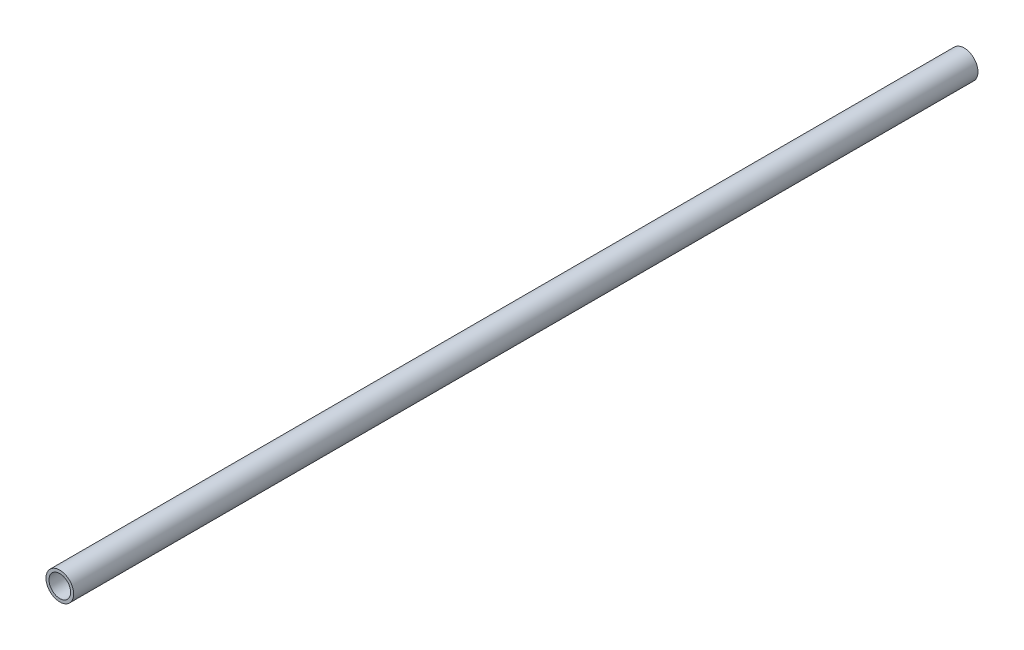
ISO-10303-21;
HEADER;
FILE_DESCRIPTION(('STEP AP214'),'2;1');
FILE_NAME('part.step','',(''),(''),'','','');
FILE_SCHEMA(('AUTOMOTIVE_DESIGN { 1 0 10303 214 1 1 1 1 }'));
ENDSEC;
DATA;
#1=APPLICATION_CONTEXT('core data for automotive mechanical design processes');
#2=APPLICATION_PROTOCOL_DEFINITION('international standard','automotive_design',2000,#1);
#3=PRODUCT_CONTEXT('',#1,'mechanical');
#4=PRODUCT('Part','Part','',(#3));
#5=PRODUCT_RELATED_PRODUCT_CATEGORY('part','',(#4));
#6=PRODUCT_DEFINITION_FORMATION('','',#4);
#7=PRODUCT_DEFINITION_CONTEXT('part definition',#1,'design');
#8=PRODUCT_DEFINITION('design','',#6,#7);
#9=PRODUCT_DEFINITION_SHAPE('','',#8);
#10=(LENGTH_UNIT() NAMED_UNIT(*) SI_UNIT(.MILLI.,.METRE.));
#11=(NAMED_UNIT(*) PLANE_ANGLE_UNIT() SI_UNIT($,.RADIAN.));
#12=(NAMED_UNIT(*) SI_UNIT($,.STERADIAN.) SOLID_ANGLE_UNIT());
#13=UNCERTAINTY_MEASURE_WITH_UNIT(LENGTH_MEASURE(1.E-05),#10,'distance_accuracy_value','');
#14=(GEOMETRIC_REPRESENTATION_CONTEXT(3) GLOBAL_UNCERTAINTY_ASSIGNED_CONTEXT((#13)) GLOBAL_UNIT_ASSIGNED_CONTEXT((#10,
#11,#12)) REPRESENTATION_CONTEXT('',''));
#15=CARTESIAN_POINT('',(0.,0.,0.));
#16=DIRECTION('',(0.,0.,1.));
#17=DIRECTION('',(1.,0.,0.));
#18=AXIS2_PLACEMENT_3D('',#15,#16,#17);
#19=CARTESIAN_POINT('',(0.,0.,1092.2));
#20=DIRECTION('',(0.,0.,1.));
#21=DIRECTION('',(1.,0.,0.));
#22=AXIS2_PLACEMENT_3D('',#19,#20,#21);
#23=CYLINDRICAL_SURFACE('',#22,13.0683);
#24=CARTESIAN_POINT('',(0.,0.,0.));
#25=DIRECTION('',(0.,0.,1.));
#26=DIRECTION('',(1.,0.,0.));
#27=AXIS2_PLACEMENT_3D('',#24,#25,#26);
#28=CIRCLE('',#27,13.0683);
#29=CARTESIAN_POINT('',(13.0683,0.,0.));
#30=VERTEX_POINT('',#29);
#31=EDGE_CURVE('E24',#30,#30,#28,.F.);
#32=ORIENTED_EDGE('',*,*,#31,.T.);
#33=EDGE_LOOP('',(#32));
#34=FACE_BOUND('',#33,.T.);
#35=CARTESIAN_POINT('',(0.,0.,1092.2));
#36=DIRECTION('',(0.,0.,1.));
#37=DIRECTION('',(1.,0.,0.));
#38=AXIS2_PLACEMENT_3D('',#35,#36,#37);
#39=CIRCLE('',#38,13.0683);
#40=CARTESIAN_POINT('',(13.0683,0.,1092.2));
#41=VERTEX_POINT('',#40);
#42=EDGE_CURVE('E15',#41,#41,#39,.F.);
#43=ORIENTED_EDGE('',*,*,#42,.F.);
#44=EDGE_LOOP('',(#43));
#45=FACE_BOUND('',#44,.T.);
#46=ADVANCED_FACE('F12',(#34,#45),#23,.F.);
#47=CARTESIAN_POINT('',(0.,0.,1092.2));
#48=DIRECTION('',(0.,0.,1.));
#49=DIRECTION('',(1.,0.,0.));
#50=AXIS2_PLACEMENT_3D('',#47,#48,#49);
#51=PLANE('',#50);
#52=CARTESIAN_POINT('',(0.,0.,1092.2));
#53=DIRECTION('',(0.,0.,1.));
#54=DIRECTION('',(1.,0.,0.));
#55=AXIS2_PLACEMENT_3D('',#52,#53,#54);
#56=CIRCLE('',#55,16.7005);
#57=CARTESIAN_POINT('',(16.7005,0.,1092.2));
#58=VERTEX_POINT('',#57);
#59=EDGE_CURVE('E19',#58,#58,#56,.F.);
#60=ORIENTED_EDGE('',*,*,#59,.F.);
#61=EDGE_LOOP('',(#60));
#62=FACE_BOUND('',#61,.T.);
#63=ORIENTED_EDGE('',*,*,#42,.T.);
#64=EDGE_LOOP('',(#63));
#65=FACE_BOUND('',#64,.T.);
#66=ADVANCED_FACE('F32',(#62,#65),#51,.T.);
#67=CARTESIAN_POINT('',(0.,0.,0.));
#68=DIRECTION('',(0.,0.,1.));
#69=DIRECTION('',(1.,0.,0.));
#70=AXIS2_PLACEMENT_3D('',#67,#68,#69);
#71=PLANE('',#70);
#72=CARTESIAN_POINT('',(0.,0.,0.));
#73=DIRECTION('',(0.,0.,1.));
#74=DIRECTION('',(1.,0.,0.));
#75=AXIS2_PLACEMENT_3D('',#72,#73,#74);
#76=CIRCLE('',#75,16.7005);
#77=CARTESIAN_POINT('',(16.7005,0.,0.));
#78=VERTEX_POINT('',#77);
#79=EDGE_CURVE('E8',#78,#78,#76,.T.);
#80=ORIENTED_EDGE('',*,*,#79,.F.);
#81=EDGE_LOOP('',(#80));
#82=FACE_BOUND('',#81,.T.);
#83=ORIENTED_EDGE('',*,*,#31,.F.);
#84=EDGE_LOOP('',(#83));
#85=FACE_BOUND('',#84,.T.);
#86=ADVANCED_FACE('F39',(#82,#85),#71,.F.);
#87=CARTESIAN_POINT('',(0.,0.,1092.2));
#88=DIRECTION('',(0.,0.,1.));
#89=DIRECTION('',(1.,0.,0.));
#90=AXIS2_PLACEMENT_3D('',#87,#88,#89);
#91=CYLINDRICAL_SURFACE('',#90,16.7005);
#92=ORIENTED_EDGE('',*,*,#79,.T.);
#93=EDGE_LOOP('',(#92));
#94=FACE_BOUND('',#93,.T.);
#95=ORIENTED_EDGE('',*,*,#59,.T.);
#96=EDGE_LOOP('',(#95));
#97=FACE_BOUND('',#96,.T.);
#98=ADVANCED_FACE('F41',(#94,#97),#91,.T.);
#99=CLOSED_SHELL('',(#46,#66,#86,#98));
#100=MANIFOLD_SOLID_BREP('B1',#99);
#101=ADVANCED_BREP_SHAPE_REPRESENTATION('',(#18,#100),#14);
#102=SHAPE_DEFINITION_REPRESENTATION(#9,#101);
ENDSEC;
END-ISO-10303-21;
